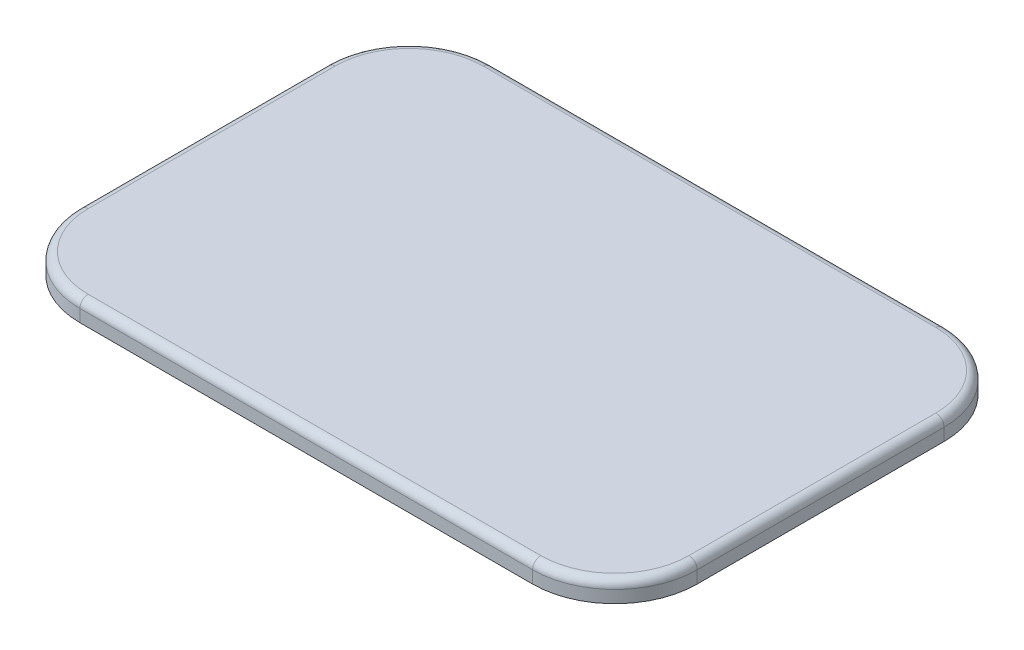
ISO-10303-21;
HEADER;
FILE_DESCRIPTION(('STEP AP214'),'2;1');
FILE_NAME('part.step','',(''),(''),'','','');
FILE_SCHEMA(('AUTOMOTIVE_DESIGN { 1 0 10303 214 1 1 1 1 }'));
ENDSEC;
DATA;
#1=APPLICATION_CONTEXT('core data for automotive mechanical design processes');
#2=APPLICATION_PROTOCOL_DEFINITION('international standard','automotive_design',2000,#1);
#3=PRODUCT_CONTEXT('',#1,'mechanical');
#4=PRODUCT('Part','Part','',(#3));
#5=PRODUCT_RELATED_PRODUCT_CATEGORY('part','',(#4));
#6=PRODUCT_DEFINITION_FORMATION('','',#4);
#7=PRODUCT_DEFINITION_CONTEXT('part definition',#1,'design');
#8=PRODUCT_DEFINITION('design','',#6,#7);
#9=PRODUCT_DEFINITION_SHAPE('','',#8);
#10=(LENGTH_UNIT() NAMED_UNIT(*) SI_UNIT(.MILLI.,.METRE.));
#11=(NAMED_UNIT(*) PLANE_ANGLE_UNIT() SI_UNIT($,.RADIAN.));
#12=(NAMED_UNIT(*) SI_UNIT($,.STERADIAN.) SOLID_ANGLE_UNIT());
#13=UNCERTAINTY_MEASURE_WITH_UNIT(LENGTH_MEASURE(1.E-05),#10,'distance_accuracy_value','');
#14=(GEOMETRIC_REPRESENTATION_CONTEXT(3) GLOBAL_UNCERTAINTY_ASSIGNED_CONTEXT((#13)) GLOBAL_UNIT_ASSIGNED_CONTEXT((#10,
#11,#12)) REPRESENTATION_CONTEXT('',''));
#15=CARTESIAN_POINT('',(0.,0.,0.));
#16=DIRECTION('',(0.,0.,1.));
#17=DIRECTION('',(1.,0.,0.));
#18=AXIS2_PLACEMENT_3D('',#15,#16,#17);
#19=CARTESIAN_POINT('',(110.,10.,-60.));
#20=DIRECTION('',(0.,-1.,0.));
#21=DIRECTION('',(0.,0.,-1.));
#22=AXIS2_PLACEMENT_3D('',#19,#20,#21);
#23=CYLINDRICAL_SURFACE('',#22,40.);
#24=DIRECTION('',(0.,-1.,0.));
#25=VECTOR('',#24,1.);
#26=CARTESIAN_POINT('',(110.,10.,-100.));
#27=LINE('',#26,#25);
#28=CARTESIAN_POINT('',(110.,6.,-100.));
#29=VERTEX_POINT('',#28);
#30=CARTESIAN_POINT('',(110.,0.,-100.));
#31=VERTEX_POINT('',#30);
#32=EDGE_CURVE('E130',#29,#31,#27,.T.);
#33=ORIENTED_EDGE('',*,*,#32,.F.);
#34=CARTESIAN_POINT('',(110.,6.,-60.));
#35=DIRECTION('',(0.,-1.,0.));
#36=DIRECTION('',(0.,0.,-1.));
#37=AXIS2_PLACEMENT_3D('',#34,#35,#36);
#38=CIRCLE('',#37,40.);
#39=CARTESIAN_POINT('',(150.,6.,-59.9999999999997));
#40=VERTEX_POINT('',#39);
#41=EDGE_CURVE('E239',#29,#40,#38,.T.);
#42=ORIENTED_EDGE('',*,*,#41,.T.);
#43=DIRECTION('',(0.,-1.,0.));
#44=VECTOR('',#43,1.);
#45=CARTESIAN_POINT('',(150.,10.,-59.9999999999997));
#46=LINE('',#45,#44);
#47=CARTESIAN_POINT('',(150.,0.,-59.9999999999997));
#48=VERTEX_POINT('',#47);
#49=EDGE_CURVE('E155',#40,#48,#46,.T.);
#50=ORIENTED_EDGE('',*,*,#49,.T.);
#51=CARTESIAN_POINT('',(110.,0.,-60.));
#52=DIRECTION('',(0.,1.,0.));
#53=DIRECTION('',(0.,0.,-1.));
#54=AXIS2_PLACEMENT_3D('',#51,#52,#53);
#55=CIRCLE('',#54,40.);
#56=EDGE_CURVE('E149',#48,#31,#55,.T.);
#57=ORIENTED_EDGE('',*,*,#56,.T.);
#58=EDGE_LOOP('',(#33,#42,#50,#57));
#59=FACE_BOUND('',#58,.T.);
#60=ADVANCED_FACE('F39',(#59),#23,.T.);
#61=CARTESIAN_POINT('',(-110.,10.,-100.));
#62=DIRECTION('',(0.,0.,1.));
#63=DIRECTION('',(1.,0.,0.));
#64=AXIS2_PLACEMENT_3D('',#61,#62,#63);
#65=PLANE('',#64);
#66=DIRECTION('',(0.,-1.,0.));
#67=VECTOR('',#66,1.);
#68=CARTESIAN_POINT('',(-110.,10.,-100.));
#69=LINE('',#68,#67);
#70=CARTESIAN_POINT('',(-110.,6.,-100.));
#71=VERTEX_POINT('',#70);
#72=CARTESIAN_POINT('',(-110.,0.,-100.));
#73=VERTEX_POINT('',#72);
#74=EDGE_CURVE('E143',#71,#73,#69,.T.);
#75=ORIENTED_EDGE('',*,*,#74,.F.);
#76=DIRECTION('',(-1.,0.,0.));
#77=VECTOR('',#76,1.);
#78=CARTESIAN_POINT('',(-110.,6.,-100.));
#79=LINE('',#78,#77);
#80=EDGE_CURVE('E137',#71,#29,#79,.F.);
#81=ORIENTED_EDGE('',*,*,#80,.T.);
#82=ORIENTED_EDGE('',*,*,#32,.T.);
#83=DIRECTION('',(-1.,0.,0.));
#84=VECTOR('',#83,1.);
#85=CARTESIAN_POINT('',(-110.,0.,-100.));
#86=LINE('',#85,#84);
#87=EDGE_CURVE('E134',#31,#73,#86,.T.);
#88=ORIENTED_EDGE('',*,*,#87,.T.);
#89=EDGE_LOOP('',(#75,#81,#82,#88));
#90=FACE_BOUND('',#89,.T.);
#91=ADVANCED_FACE('F133',(#90),#65,.F.);
#92=CARTESIAN_POINT('',(-110.,10.,-60.));
#93=DIRECTION('',(0.,-1.,0.));
#94=DIRECTION('',(0.,0.,-1.));
#95=AXIS2_PLACEMENT_3D('',#92,#93,#94);
#96=CYLINDRICAL_SURFACE('',#95,40.);
#97=DIRECTION('',(0.,-1.,0.));
#98=VECTOR('',#97,1.);
#99=CARTESIAN_POINT('',(-150.,10.,-59.9999999999997));
#100=LINE('',#99,#98);
#101=CARTESIAN_POINT('',(-150.,6.,-59.9999999999997));
#102=VERTEX_POINT('',#101);
#103=CARTESIAN_POINT('',(-150.,0.,-59.9999999999997));
#104=VERTEX_POINT('',#103);
#105=EDGE_CURVE('E198',#102,#104,#100,.T.);
#106=ORIENTED_EDGE('',*,*,#105,.F.);
#107=CARTESIAN_POINT('',(-110.,6.,-60.));
#108=DIRECTION('',(0.,-1.,0.));
#109=DIRECTION('',(0.,0.,-1.));
#110=AXIS2_PLACEMENT_3D('',#107,#108,#109);
#111=CIRCLE('',#110,40.);
#112=EDGE_CURVE('E234',#102,#71,#111,.T.);
#113=ORIENTED_EDGE('',*,*,#112,.T.);
#114=ORIENTED_EDGE('',*,*,#74,.T.);
#115=CARTESIAN_POINT('',(-110.,0.,-60.));
#116=DIRECTION('',(0.,1.,0.));
#117=DIRECTION('',(0.,0.,-1.));
#118=AXIS2_PLACEMENT_3D('',#115,#116,#117);
#119=CIRCLE('',#118,40.);
#120=EDGE_CURVE('E152',#73,#104,#119,.T.);
#121=ORIENTED_EDGE('',*,*,#120,.T.);
#122=EDGE_LOOP('',(#106,#113,#114,#121));
#123=FACE_BOUND('',#122,.T.);
#124=ADVANCED_FACE('F313',(#123),#96,.T.);
#125=CARTESIAN_POINT('',(-150.,10.,59.9999999999997));
#126=DIRECTION('',(1.,0.,0.));
#127=DIRECTION('',(0.,0.,-1.));
#128=AXIS2_PLACEMENT_3D('',#125,#126,#127);
#129=PLANE('',#128);
#130=DIRECTION('',(0.,-1.,0.));
#131=VECTOR('',#130,1.);
#132=CARTESIAN_POINT('',(-150.,10.,59.9999999999997));
#133=LINE('',#132,#131);
#134=CARTESIAN_POINT('',(-150.,6.,59.9999999999997));
#135=VERTEX_POINT('',#134);
#136=CARTESIAN_POINT('',(-150.,0.,59.9999999999997));
#137=VERTEX_POINT('',#136);
#138=EDGE_CURVE('E195',#135,#137,#133,.T.);
#139=ORIENTED_EDGE('',*,*,#138,.F.);
#140=DIRECTION('',(0.,0.,1.));
#141=VECTOR('',#140,1.);
#142=CARTESIAN_POINT('',(-150.,6.,59.9999999999997));
#143=LINE('',#142,#141);
#144=EDGE_CURVE('E231',#135,#102,#143,.F.);
#145=ORIENTED_EDGE('',*,*,#144,.T.);
#146=ORIENTED_EDGE('',*,*,#105,.T.);
#147=DIRECTION('',(0.,0.,1.));
#148=VECTOR('',#147,1.);
#149=CARTESIAN_POINT('',(-150.,0.,59.9999999999997));
#150=LINE('',#149,#148);
#151=EDGE_CURVE('E165',#104,#137,#150,.T.);
#152=ORIENTED_EDGE('',*,*,#151,.T.);
#153=EDGE_LOOP('',(#139,#145,#146,#152));
#154=FACE_BOUND('',#153,.T.);
#155=ADVANCED_FACE('F310',(#154),#129,.F.);
#156=CARTESIAN_POINT('',(-110.,10.,60.));
#157=DIRECTION('',(0.,-1.,0.));
#158=DIRECTION('',(0.,0.,-1.));
#159=AXIS2_PLACEMENT_3D('',#156,#157,#158);
#160=CYLINDRICAL_SURFACE('',#159,40.);
#161=DIRECTION('',(0.,-1.,0.));
#162=VECTOR('',#161,1.);
#163=CARTESIAN_POINT('',(-110.,10.,100.));
#164=LINE('',#163,#162);
#165=CARTESIAN_POINT('',(-110.,6.,100.));
#166=VERTEX_POINT('',#165);
#167=CARTESIAN_POINT('',(-110.,0.,100.));
#168=VERTEX_POINT('',#167);
#169=EDGE_CURVE('E192',#166,#168,#164,.T.);
#170=ORIENTED_EDGE('',*,*,#169,.F.);
#171=CARTESIAN_POINT('',(-110.,6.,60.));
#172=DIRECTION('',(0.,-1.,0.));
#173=DIRECTION('',(0.,0.,-1.));
#174=AXIS2_PLACEMENT_3D('',#171,#172,#173);
#175=CIRCLE('',#174,40.);
#176=EDGE_CURVE('E227',#166,#135,#175,.T.);
#177=ORIENTED_EDGE('',*,*,#176,.T.);
#178=ORIENTED_EDGE('',*,*,#138,.T.);
#179=CARTESIAN_POINT('',(-110.,0.,60.));
#180=DIRECTION('',(0.,1.,0.));
#181=DIRECTION('',(0.,0.,-1.));
#182=AXIS2_PLACEMENT_3D('',#179,#180,#181);
#183=CIRCLE('',#182,40.);
#184=EDGE_CURVE('E169',#137,#168,#183,.T.);
#185=ORIENTED_EDGE('',*,*,#184,.T.);
#186=EDGE_LOOP('',(#170,#177,#178,#185));
#187=FACE_BOUND('',#186,.T.);
#188=ADVANCED_FACE('F295',(#187),#160,.T.);
#189=CARTESIAN_POINT('',(-110.,10.,100.));
#190=DIRECTION('',(0.,0.,-1.));
#191=DIRECTION('',(-1.,0.,0.));
#192=AXIS2_PLACEMENT_3D('',#189,#190,#191);
#193=PLANE('',#192);
#194=DIRECTION('',(0.,-1.,0.));
#195=VECTOR('',#194,1.);
#196=CARTESIAN_POINT('',(110.,10.,100.));
#197=LINE('',#196,#195);
#198=CARTESIAN_POINT('',(110.,6.,100.));
#199=VERTEX_POINT('',#198);
#200=CARTESIAN_POINT('',(110.,0.,100.));
#201=VERTEX_POINT('',#200);
#202=EDGE_CURVE('E189',#199,#201,#197,.T.);
#203=ORIENTED_EDGE('',*,*,#202,.F.);
#204=DIRECTION('',(1.,0.,0.));
#205=VECTOR('',#204,1.);
#206=CARTESIAN_POINT('',(-110.,6.,100.));
#207=LINE('',#206,#205);
#208=EDGE_CURVE('E11',#199,#166,#207,.F.);
#209=ORIENTED_EDGE('',*,*,#208,.T.);
#210=ORIENTED_EDGE('',*,*,#169,.T.);
#211=DIRECTION('',(1.,0.,0.));
#212=VECTOR('',#211,1.);
#213=CARTESIAN_POINT('',(-110.,0.,100.));
#214=LINE('',#213,#212);
#215=EDGE_CURVE('E173',#168,#201,#214,.T.);
#216=ORIENTED_EDGE('',*,*,#215,.T.);
#217=EDGE_LOOP('',(#203,#209,#210,#216));
#218=FACE_BOUND('',#217,.T.);
#219=ADVANCED_FACE('F292',(#218),#193,.F.);
#220=CARTESIAN_POINT('',(110.,10.,60.));
#221=DIRECTION('',(0.,-1.,0.));
#222=DIRECTION('',(0.,0.,-1.));
#223=AXIS2_PLACEMENT_3D('',#220,#221,#222);
#224=CYLINDRICAL_SURFACE('',#223,40.);
#225=DIRECTION('',(0.,-1.,0.));
#226=VECTOR('',#225,1.);
#227=CARTESIAN_POINT('',(150.,10.,59.9999999999997));
#228=LINE('',#227,#226);
#229=CARTESIAN_POINT('',(150.,6.,59.9999999999997));
#230=VERTEX_POINT('',#229);
#231=CARTESIAN_POINT('',(150.,0.,59.9999999999997));
#232=VERTEX_POINT('',#231);
#233=EDGE_CURVE('E186',#230,#232,#228,.T.);
#234=ORIENTED_EDGE('',*,*,#233,.F.);
#235=CARTESIAN_POINT('',(110.,6.,60.));
#236=DIRECTION('',(0.,-1.,0.));
#237=DIRECTION('',(0.,0.,-1.));
#238=AXIS2_PLACEMENT_3D('',#235,#236,#237);
#239=CIRCLE('',#238,40.);
#240=EDGE_CURVE('E49',#230,#199,#239,.T.);
#241=ORIENTED_EDGE('',*,*,#240,.T.);
#242=ORIENTED_EDGE('',*,*,#202,.T.);
#243=CARTESIAN_POINT('',(110.,0.,60.));
#244=DIRECTION('',(0.,1.,0.));
#245=DIRECTION('',(0.,0.,1.));
#246=AXIS2_PLACEMENT_3D('',#243,#244,#245);
#247=CIRCLE('',#246,40.);
#248=EDGE_CURVE('E177',#201,#232,#247,.T.);
#249=ORIENTED_EDGE('',*,*,#248,.T.);
#250=EDGE_LOOP('',(#234,#241,#242,#249));
#251=FACE_BOUND('',#250,.T.);
#252=ADVANCED_FACE('F408',(#251),#224,.T.);
#253=CARTESIAN_POINT('',(150.,10.,59.9999999999997));
#254=DIRECTION('',(-1.,0.,0.));
#255=DIRECTION('',(0.,0.,1.));
#256=AXIS2_PLACEMENT_3D('',#253,#254,#255);
#257=PLANE('',#256);
#258=ORIENTED_EDGE('',*,*,#49,.F.);
#259=DIRECTION('',(0.,0.,-1.));
#260=VECTOR('',#259,1.);
#261=CARTESIAN_POINT('',(150.,6.,59.9999999999997));
#262=LINE('',#261,#260);
#263=EDGE_CURVE('E64',#40,#230,#262,.F.);
#264=ORIENTED_EDGE('',*,*,#263,.T.);
#265=ORIENTED_EDGE('',*,*,#233,.T.);
#266=DIRECTION('',(0.,0.,-1.));
#267=VECTOR('',#266,1.);
#268=CARTESIAN_POINT('',(150.,0.,59.9999999999997));
#269=LINE('',#268,#267);
#270=EDGE_CURVE('E181',#232,#48,#269,.T.);
#271=ORIENTED_EDGE('',*,*,#270,.T.);
#272=EDGE_LOOP('',(#258,#264,#265,#271));
#273=FACE_BOUND('',#272,.T.);
#274=ADVANCED_FACE('F400',(#273),#257,.F.);
#275=CARTESIAN_POINT('',(110.,10.,-60.));
#276=DIRECTION('',(0.,-1.,0.));
#277=DIRECTION('',(0.,0.,-1.));
#278=AXIS2_PLACEMENT_3D('',#275,#276,#277);
#279=PLANE('',#278);
#280=DIRECTION('',(0.,0.,1.));
#281=VECTOR('',#280,1.);
#282=CARTESIAN_POINT('',(-146.,10.,-60.));
#283=LINE('',#282,#281);
#284=CARTESIAN_POINT('',(-146.,10.,-59.9999999999997));
#285=VERTEX_POINT('',#284);
#286=CARTESIAN_POINT('',(-146.,10.,59.9999999999998));
#287=VERTEX_POINT('',#286);
#288=EDGE_CURVE('E220',#285,#287,#283,.T.);
#289=ORIENTED_EDGE('',*,*,#288,.T.);
#290=CARTESIAN_POINT('',(-110.,10.,60.));
#291=DIRECTION('',(0.,-1.,0.));
#292=DIRECTION('',(0.,0.,-1.));
#293=AXIS2_PLACEMENT_3D('',#290,#291,#292);
#294=CIRCLE('',#293,36.);
#295=CARTESIAN_POINT('',(-110.,10.,96.));
#296=VERTEX_POINT('',#295);
#297=EDGE_CURVE('E223',#287,#296,#294,.F.);
#298=ORIENTED_EDGE('',*,*,#297,.T.);
#299=DIRECTION('',(1.,0.,0.));
#300=VECTOR('',#299,1.);
#301=CARTESIAN_POINT('',(110.,10.,96.));
#302=LINE('',#301,#300);
#303=CARTESIAN_POINT('',(110.,10.,96.));
#304=VERTEX_POINT('',#303);
#305=EDGE_CURVE('E142',#296,#304,#302,.T.);
#306=ORIENTED_EDGE('',*,*,#305,.T.);
#307=CARTESIAN_POINT('',(110.,10.,60.));
#308=DIRECTION('',(0.,-1.,0.));
#309=DIRECTION('',(0.,0.,-1.));
#310=AXIS2_PLACEMENT_3D('',#307,#308,#309);
#311=CIRCLE('',#310,36.);
#312=CARTESIAN_POINT('',(146.,10.,59.9999999999997));
#313=VERTEX_POINT('',#312);
#314=EDGE_CURVE('E205',#304,#313,#311,.F.);
#315=ORIENTED_EDGE('',*,*,#314,.T.);
#316=DIRECTION('',(0.,0.,-1.));
#317=VECTOR('',#316,1.);
#318=CARTESIAN_POINT('',(146.,10.,-60.));
#319=LINE('',#318,#317);
#320=CARTESIAN_POINT('',(146.,10.,-59.9999999999997));
#321=VERTEX_POINT('',#320);
#322=EDGE_CURVE('E208',#313,#321,#319,.T.);
#323=ORIENTED_EDGE('',*,*,#322,.T.);
#324=CARTESIAN_POINT('',(110.,10.,-60.));
#325=DIRECTION('',(0.,-1.,0.));
#326=DIRECTION('',(0.,0.,-1.));
#327=AXIS2_PLACEMENT_3D('',#324,#325,#326);
#328=CIRCLE('',#327,36.);
#329=CARTESIAN_POINT('',(110.,10.,-96.));
#330=VERTEX_POINT('',#329);
#331=EDGE_CURVE('E211',#321,#330,#328,.F.);
#332=ORIENTED_EDGE('',*,*,#331,.T.);
#333=DIRECTION('',(-1.,0.,0.));
#334=VECTOR('',#333,1.);
#335=CARTESIAN_POINT('',(110.,10.,-96.));
#336=LINE('',#335,#334);
#337=CARTESIAN_POINT('',(-110.,10.,-96.));
#338=VERTEX_POINT('',#337);
#339=EDGE_CURVE('E214',#330,#338,#336,.T.);
#340=ORIENTED_EDGE('',*,*,#339,.T.);
#341=CARTESIAN_POINT('',(-110.,10.,-60.));
#342=DIRECTION('',(0.,-1.,0.));
#343=DIRECTION('',(0.,0.,-1.));
#344=AXIS2_PLACEMENT_3D('',#341,#342,#343);
#345=CIRCLE('',#344,36.);
#346=EDGE_CURVE('E217',#338,#285,#345,.F.);
#347=ORIENTED_EDGE('',*,*,#346,.T.);
#348=EDGE_LOOP('',(#289,#298,#306,#315,#323,#332,#340,#347));
#349=FACE_BOUND('',#348,.T.);
#350=ADVANCED_FACE('F279',(#349),#279,.F.);
#351=CARTESIAN_POINT('',(110.,0.,-60.));
#352=DIRECTION('',(0.,-1.,0.));
#353=DIRECTION('',(0.,0.,-1.));
#354=AXIS2_PLACEMENT_3D('',#351,#352,#353);
#355=PLANE('',#354);
#356=ORIENTED_EDGE('',*,*,#56,.F.);
#357=ORIENTED_EDGE('',*,*,#270,.F.);
#358=ORIENTED_EDGE('',*,*,#248,.F.);
#359=ORIENTED_EDGE('',*,*,#215,.F.);
#360=ORIENTED_EDGE('',*,*,#184,.F.);
#361=ORIENTED_EDGE('',*,*,#151,.F.);
#362=ORIENTED_EDGE('',*,*,#120,.F.);
#363=ORIENTED_EDGE('',*,*,#87,.F.);
#364=EDGE_LOOP('',(#356,#357,#358,#359,#360,#361,#362,#363));
#365=FACE_BOUND('',#364,.T.);
#366=ADVANCED_FACE('F147',(#365),#355,.T.);
#367=CARTESIAN_POINT('',(110.,6.,-60.));
#368=DIRECTION('',(0.,-1.,0.));
#369=DIRECTION('',(0.,0.,-1.));
#370=AXIS2_PLACEMENT_3D('',#367,#368,#369);
#371=TOROIDAL_SURFACE('',#370,36.,4.);
#372=CARTESIAN_POINT('',(146.,6.,-59.9999999999997));
#373=DIRECTION('',(0.,0.,1.));
#374=DIRECTION('',(1.,0.,0.));
#375=AXIS2_PLACEMENT_3D('',#372,#373,#374);
#376=CIRCLE('',#375,4.);
#377=EDGE_CURVE('E161',#40,#321,#376,.T.);
#378=ORIENTED_EDGE('',*,*,#377,.F.);
#379=ORIENTED_EDGE('',*,*,#41,.F.);
#380=CARTESIAN_POINT('',(110.,6.,-96.));
#381=DIRECTION('',(-1.,0.,0.));
#382=DIRECTION('',(0.,0.,1.));
#383=AXIS2_PLACEMENT_3D('',#380,#381,#382);
#384=CIRCLE('',#383,4.);
#385=EDGE_CURVE('E43',#330,#29,#384,.T.);
#386=ORIENTED_EDGE('',*,*,#385,.F.);
#387=ORIENTED_EDGE('',*,*,#331,.F.);
#388=EDGE_LOOP('',(#378,#379,#386,#387));
#389=FACE_BOUND('',#388,.T.);
#390=ADVANCED_FACE('F41',(#389),#371,.T.);
#391=CARTESIAN_POINT('',(110.,6.,-96.));
#392=DIRECTION('',(-1.,0.,0.));
#393=DIRECTION('',(0.,0.,1.));
#394=AXIS2_PLACEMENT_3D('',#391,#392,#393);
#395=CYLINDRICAL_SURFACE('',#394,4.);
#396=ORIENTED_EDGE('',*,*,#385,.T.);
#397=ORIENTED_EDGE('',*,*,#80,.F.);
#398=CARTESIAN_POINT('',(-110.,6.,-96.));
#399=DIRECTION('',(-1.,0.,0.));
#400=DIRECTION('',(0.,0.,1.));
#401=AXIS2_PLACEMENT_3D('',#398,#399,#400);
#402=CIRCLE('',#401,4.);
#403=EDGE_CURVE('E264',#338,#71,#402,.T.);
#404=ORIENTED_EDGE('',*,*,#403,.F.);
#405=ORIENTED_EDGE('',*,*,#339,.F.);
#406=EDGE_LOOP('',(#396,#397,#404,#405));
#407=FACE_BOUND('',#406,.T.);
#408=ADVANCED_FACE('F318',(#407),#395,.T.);
#409=CARTESIAN_POINT('',(146.,6.,-60.));
#410=DIRECTION('',(0.,0.,-1.));
#411=DIRECTION('',(-1.,0.,0.));
#412=AXIS2_PLACEMENT_3D('',#409,#410,#411);
#413=CYLINDRICAL_SURFACE('',#412,4.);
#414=ORIENTED_EDGE('',*,*,#377,.T.);
#415=ORIENTED_EDGE('',*,*,#322,.F.);
#416=CARTESIAN_POINT('',(146.,6.,59.9999999999997));
#417=DIRECTION('',(0.,0.,1.));
#418=DIRECTION('',(1.,0.,0.));
#419=AXIS2_PLACEMENT_3D('',#416,#417,#418);
#420=CIRCLE('',#419,4.);
#421=EDGE_CURVE('E260',#230,#313,#420,.T.);
#422=ORIENTED_EDGE('',*,*,#421,.F.);
#423=ORIENTED_EDGE('',*,*,#263,.F.);
#424=EDGE_LOOP('',(#414,#415,#422,#423));
#425=FACE_BOUND('',#424,.T.);
#426=ADVANCED_FACE('F272',(#425),#413,.T.);
#427=CARTESIAN_POINT('',(-110.,6.,-60.));
#428=DIRECTION('',(0.,-1.,0.));
#429=DIRECTION('',(0.,0.,-1.));
#430=AXIS2_PLACEMENT_3D('',#427,#428,#429);
#431=TOROIDAL_SURFACE('',#430,36.,4.);
#432=ORIENTED_EDGE('',*,*,#403,.T.);
#433=ORIENTED_EDGE('',*,*,#112,.F.);
#434=CARTESIAN_POINT('',(-146.,6.,-59.9999999999997));
#435=DIRECTION('',(0.,0.,1.));
#436=DIRECTION('',(1.,0.,0.));
#437=AXIS2_PLACEMENT_3D('',#434,#435,#436);
#438=CIRCLE('',#437,4.);
#439=EDGE_CURVE('E256',#285,#102,#438,.T.);
#440=ORIENTED_EDGE('',*,*,#439,.F.);
#441=ORIENTED_EDGE('',*,*,#346,.F.);
#442=EDGE_LOOP('',(#432,#433,#440,#441));
#443=FACE_BOUND('',#442,.T.);
#444=ADVANCED_FACE('F315',(#443),#431,.T.);
#445=CARTESIAN_POINT('',(110.,6.,60.));
#446=DIRECTION('',(0.,-1.,0.));
#447=DIRECTION('',(0.,0.,-1.));
#448=AXIS2_PLACEMENT_3D('',#445,#446,#447);
#449=TOROIDAL_SURFACE('',#448,36.,4.);
#450=ORIENTED_EDGE('',*,*,#421,.T.);
#451=ORIENTED_EDGE('',*,*,#314,.F.);
#452=CARTESIAN_POINT('',(110.,6.,96.));
#453=DIRECTION('',(-1.,0.,0.));
#454=DIRECTION('',(0.,0.,1.));
#455=AXIS2_PLACEMENT_3D('',#452,#453,#454);
#456=CIRCLE('',#455,4.);
#457=EDGE_CURVE('E252',#199,#304,#456,.T.);
#458=ORIENTED_EDGE('',*,*,#457,.F.);
#459=ORIENTED_EDGE('',*,*,#240,.F.);
#460=EDGE_LOOP('',(#450,#451,#458,#459));
#461=FACE_BOUND('',#460,.T.);
#462=ADVANCED_FACE('F285',(#461),#449,.T.);
#463=CARTESIAN_POINT('',(-146.,6.,-60.));
#464=DIRECTION('',(0.,0.,1.));
#465=DIRECTION('',(1.,0.,0.));
#466=AXIS2_PLACEMENT_3D('',#463,#464,#465);
#467=CYLINDRICAL_SURFACE('',#466,4.);
#468=ORIENTED_EDGE('',*,*,#439,.T.);
#469=ORIENTED_EDGE('',*,*,#144,.F.);
#470=CARTESIAN_POINT('',(-146.,6.,59.9999999999998));
#471=DIRECTION('',(0.,0.,1.));
#472=DIRECTION('',(1.,0.,0.));
#473=AXIS2_PLACEMENT_3D('',#470,#471,#472);
#474=CIRCLE('',#473,4.);
#475=EDGE_CURVE('E249',#287,#135,#474,.T.);
#476=ORIENTED_EDGE('',*,*,#475,.F.);
#477=ORIENTED_EDGE('',*,*,#288,.F.);
#478=EDGE_LOOP('',(#468,#469,#476,#477));
#479=FACE_BOUND('',#478,.T.);
#480=ADVANCED_FACE('F306',(#479),#467,.T.);
#481=CARTESIAN_POINT('',(110.,6.,96.));
#482=DIRECTION('',(1.,0.,0.));
#483=DIRECTION('',(0.,0.,-1.));
#484=AXIS2_PLACEMENT_3D('',#481,#482,#483);
#485=CYLINDRICAL_SURFACE('',#484,4.);
#486=ORIENTED_EDGE('',*,*,#457,.T.);
#487=ORIENTED_EDGE('',*,*,#305,.F.);
#488=CARTESIAN_POINT('',(-110.,6.,96.));
#489=DIRECTION('',(-1.,0.,0.));
#490=DIRECTION('',(0.,-1.,0.));
#491=AXIS2_PLACEMENT_3D('',#488,#489,#490);
#492=CIRCLE('',#491,4.);
#493=EDGE_CURVE('E246',#166,#296,#492,.T.);
#494=ORIENTED_EDGE('',*,*,#493,.F.);
#495=ORIENTED_EDGE('',*,*,#208,.F.);
#496=EDGE_LOOP('',(#486,#487,#494,#495));
#497=FACE_BOUND('',#496,.T.);
#498=ADVANCED_FACE('F288',(#497),#485,.T.);
#499=CARTESIAN_POINT('',(-110.,6.,60.));
#500=DIRECTION('',(0.,-1.,0.));
#501=DIRECTION('',(0.,0.,-1.));
#502=AXIS2_PLACEMENT_3D('',#499,#500,#501);
#503=TOROIDAL_SURFACE('',#502,36.,4.);
#504=ORIENTED_EDGE('',*,*,#475,.T.);
#505=ORIENTED_EDGE('',*,*,#176,.F.);
#506=ORIENTED_EDGE('',*,*,#493,.T.);
#507=ORIENTED_EDGE('',*,*,#297,.F.);
#508=EDGE_LOOP('',(#504,#505,#506,#507));
#509=FACE_BOUND('',#508,.T.);
#510=ADVANCED_FACE('F300',(#509),#503,.T.);
#511=CLOSED_SHELL('',(#60,#91,#124,#155,#188,#219,#252,#274,#350,#366,#390,#408,#426,#444,#462,
#480,#498,#510));
#512=MANIFOLD_SOLID_BREP('B2',#511);
#513=ADVANCED_BREP_SHAPE_REPRESENTATION('',(#18,#512),#14);
#514=SHAPE_DEFINITION_REPRESENTATION(#9,#513);
ENDSEC;
END-ISO-10303-21;
